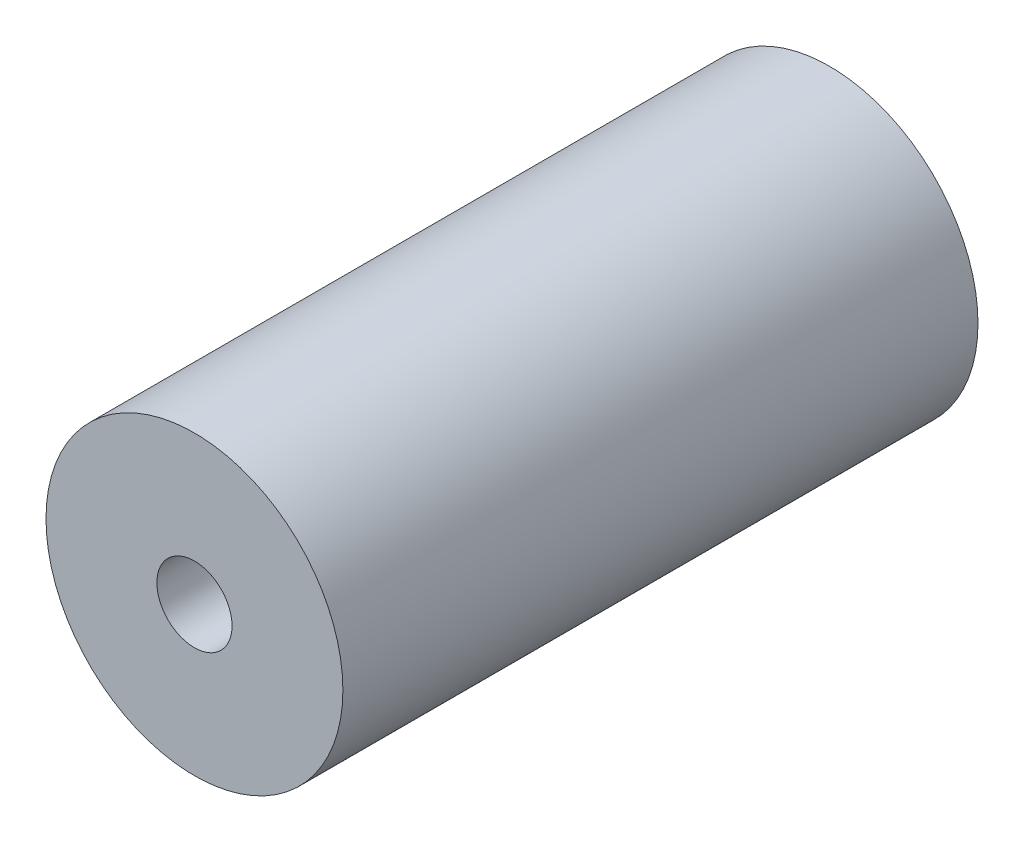
ISO-10303-21;
HEADER;
FILE_DESCRIPTION(('STEP AP214'),'2;1');
FILE_NAME('part.step','',(''),(''),'','','');
FILE_SCHEMA(('AUTOMOTIVE_DESIGN { 1 0 10303 214 1 1 1 1 }'));
ENDSEC;
DATA;
#1=APPLICATION_CONTEXT('core data for automotive mechanical design processes');
#2=APPLICATION_PROTOCOL_DEFINITION('international standard','automotive_design',2000,#1);
#3=PRODUCT_CONTEXT('',#1,'mechanical');
#4=PRODUCT('Part','Part','',(#3));
#5=PRODUCT_RELATED_PRODUCT_CATEGORY('part','',(#4));
#6=PRODUCT_DEFINITION_FORMATION('','',#4);
#7=PRODUCT_DEFINITION_CONTEXT('part definition',#1,'design');
#8=PRODUCT_DEFINITION('design','',#6,#7);
#9=PRODUCT_DEFINITION_SHAPE('','',#8);
#10=(LENGTH_UNIT() NAMED_UNIT(*) SI_UNIT(.MILLI.,.METRE.));
#11=(NAMED_UNIT(*) PLANE_ANGLE_UNIT() SI_UNIT($,.RADIAN.));
#12=(NAMED_UNIT(*) SI_UNIT($,.STERADIAN.) SOLID_ANGLE_UNIT());
#13=UNCERTAINTY_MEASURE_WITH_UNIT(LENGTH_MEASURE(1.E-05),#10,'distance_accuracy_value','');
#14=(GEOMETRIC_REPRESENTATION_CONTEXT(3) GLOBAL_UNCERTAINTY_ASSIGNED_CONTEXT((#13)) GLOBAL_UNIT_ASSIGNED_CONTEXT((#10,
#11,#12)) REPRESENTATION_CONTEXT('',''));
#15=CARTESIAN_POINT('',(0.,0.,0.));
#16=DIRECTION('',(0.,0.,1.));
#17=DIRECTION('',(1.,0.,0.));
#18=AXIS2_PLACEMENT_3D('',#15,#16,#17);
#19=CARTESIAN_POINT('',(0.,0.,8.45));
#20=DIRECTION('',(0.,0.,1.));
#21=DIRECTION('',(1.,0.,0.));
#22=AXIS2_PLACEMENT_3D('',#19,#20,#21);
#23=PLANE('',#22);
#24=CARTESIAN_POINT('',(0.,0.,8.45));
#25=DIRECTION('',(0.,0.,1.));
#26=DIRECTION('',(1.,0.,0.));
#27=AXIS2_PLACEMENT_3D('',#24,#25,#26);
#28=CIRCLE('',#27,1.975);
#29=CARTESIAN_POINT('',(1.975,0.,8.45));
#30=VERTEX_POINT('',#29);
#31=EDGE_CURVE('E10',#30,#30,#28,.T.);
#32=ORIENTED_EDGE('',*,*,#31,.T.);
#33=EDGE_LOOP('',(#32));
#34=FACE_BOUND('',#33,.T.);
#35=CARTESIAN_POINT('',(0.,0.,8.45));
#36=DIRECTION('',(0.,0.,1.));
#37=DIRECTION('',(1.,0.,0.));
#38=AXIS2_PLACEMENT_3D('',#35,#36,#37);
#39=CIRCLE('',#38,0.5);
#40=CARTESIAN_POINT('',(0.5,0.,8.45));
#41=VERTEX_POINT('',#40);
#42=EDGE_CURVE('E51',#41,#41,#39,.T.);
#43=ORIENTED_EDGE('',*,*,#42,.F.);
#44=EDGE_LOOP('',(#43));
#45=FACE_BOUND('',#44,.T.);
#46=ADVANCED_FACE('F37',(#34,#45),#23,.T.);
#47=CARTESIAN_POINT('',(0.,0.,0.));
#48=DIRECTION('',(0.,0.,1.));
#49=DIRECTION('',(1.,0.,0.));
#50=AXIS2_PLACEMENT_3D('',#47,#48,#49);
#51=PLANE('',#50);
#52=CARTESIAN_POINT('',(0.,0.,0.));
#53=DIRECTION('',(0.,0.,1.));
#54=DIRECTION('',(1.,0.,0.));
#55=AXIS2_PLACEMENT_3D('',#52,#53,#54);
#56=CIRCLE('',#55,1.975);
#57=CARTESIAN_POINT('',(1.975,0.,0.));
#58=VERTEX_POINT('',#57);
#59=EDGE_CURVE('E41',#58,#58,#56,.T.);
#60=ORIENTED_EDGE('',*,*,#59,.F.);
#61=EDGE_LOOP('',(#60));
#62=FACE_BOUND('',#61,.T.);
#63=CARTESIAN_POINT('',(0.,0.,0.));
#64=DIRECTION('',(0.,0.,1.));
#65=DIRECTION('',(1.,0.,0.));
#66=AXIS2_PLACEMENT_3D('',#63,#64,#65);
#67=CIRCLE('',#66,0.5);
#68=CARTESIAN_POINT('',(0.5,0.,0.));
#69=VERTEX_POINT('',#68);
#70=EDGE_CURVE('E53',#69,#69,#67,.T.);
#71=ORIENTED_EDGE('',*,*,#70,.T.);
#72=EDGE_LOOP('',(#71));
#73=FACE_BOUND('',#72,.T.);
#74=ADVANCED_FACE('F66',(#62,#73),#51,.F.);
#75=CARTESIAN_POINT('',(0.,0.,8.45));
#76=DIRECTION('',(0.,0.,-1.));
#77=DIRECTION('',(-1.,0.,0.));
#78=AXIS2_PLACEMENT_3D('',#75,#76,#77);
#79=CYLINDRICAL_SURFACE('',#78,1.975);
#80=ORIENTED_EDGE('',*,*,#31,.F.);
#81=EDGE_LOOP('',(#80));
#82=FACE_BOUND('',#81,.T.);
#83=ORIENTED_EDGE('',*,*,#59,.T.);
#84=EDGE_LOOP('',(#83));
#85=FACE_BOUND('',#84,.T.);
#86=ADVANCED_FACE('F39',(#82,#85),#79,.T.);
#87=CARTESIAN_POINT('',(0.,0.,8.45));
#88=DIRECTION('',(0.,0.,-1.));
#89=DIRECTION('',(-1.,0.,0.));
#90=AXIS2_PLACEMENT_3D('',#87,#88,#89);
#91=CYLINDRICAL_SURFACE('',#90,0.5);
#92=ORIENTED_EDGE('',*,*,#42,.T.);
#93=EDGE_LOOP('',(#92));
#94=FACE_BOUND('',#93,.T.);
#95=ORIENTED_EDGE('',*,*,#70,.F.);
#96=EDGE_LOOP('',(#95));
#97=FACE_BOUND('',#96,.T.);
#98=ADVANCED_FACE('F62',(#94,#97),#91,.F.);
#99=CLOSED_SHELL('',(#46,#74,#86,#98));
#100=MANIFOLD_SOLID_BREP('B2',#99);
#101=ADVANCED_BREP_SHAPE_REPRESENTATION('',(#18,#100),#14);
#102=SHAPE_DEFINITION_REPRESENTATION(#9,#101);
ENDSEC;
END-ISO-10303-21;
